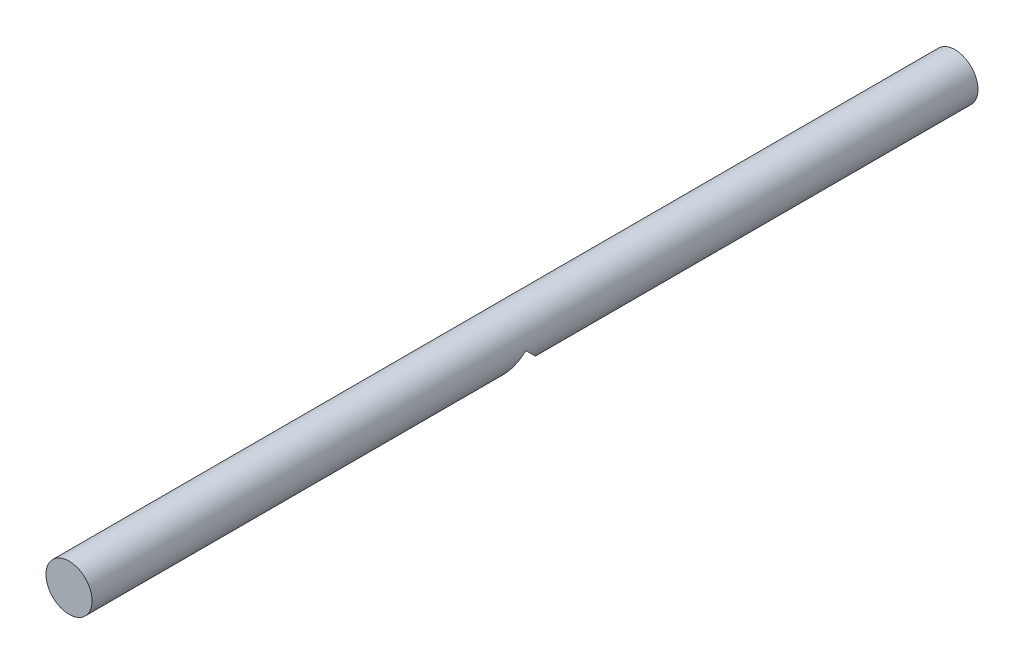
ISO-10303-21;
HEADER;
FILE_DESCRIPTION(('STEP AP214'),'2;1');
FILE_NAME('part.step','',(''),(''),'','','');
FILE_SCHEMA(('AUTOMOTIVE_DESIGN { 1 0 10303 214 1 1 1 1 }'));
ENDSEC;
DATA;
#1=APPLICATION_CONTEXT('core data for automotive mechanical design processes');
#2=APPLICATION_PROTOCOL_DEFINITION('international standard','automotive_design',2000,#1);
#3=PRODUCT_CONTEXT('',#1,'mechanical');
#4=PRODUCT('Part','Part','',(#3));
#5=PRODUCT_RELATED_PRODUCT_CATEGORY('part','',(#4));
#6=PRODUCT_DEFINITION_FORMATION('','',#4);
#7=PRODUCT_DEFINITION_CONTEXT('part definition',#1,'design');
#8=PRODUCT_DEFINITION('design','',#6,#7);
#9=PRODUCT_DEFINITION_SHAPE('','',#8);
#10=(LENGTH_UNIT() NAMED_UNIT(*) SI_UNIT(.MILLI.,.METRE.));
#11=(NAMED_UNIT(*) PLANE_ANGLE_UNIT() SI_UNIT($,.RADIAN.));
#12=(NAMED_UNIT(*) SI_UNIT($,.STERADIAN.) SOLID_ANGLE_UNIT());
#13=UNCERTAINTY_MEASURE_WITH_UNIT(LENGTH_MEASURE(1.E-05),#10,'distance_accuracy_value','');
#14=(GEOMETRIC_REPRESENTATION_CONTEXT(3) GLOBAL_UNCERTAINTY_ASSIGNED_CONTEXT((#13)) GLOBAL_UNIT_ASSIGNED_CONTEXT((#10,
#11,#12)) REPRESENTATION_CONTEXT('',''));
#15=CARTESIAN_POINT('',(0.,0.,0.));
#16=DIRECTION('',(0.,0.,1.));
#17=DIRECTION('',(1.,0.,0.));
#18=AXIS2_PLACEMENT_3D('',#15,#16,#17);
#19=CARTESIAN_POINT('',(0.,0.,480.));
#20=DIRECTION('',(0.,0.,-1.));
#21=DIRECTION('',(-1.,0.,0.));
#22=AXIS2_PLACEMENT_3D('',#19,#20,#21);
#23=CYLINDRICAL_SURFACE('',#22,12.5);
#24=CARTESIAN_POINT('',(0.,0.,245.));
#25=DIRECTION('',(0.,-0.707106781186547,-0.707106781186547));
#26=DIRECTION('',(0.,0.707106781186547,-0.707106781186547));
#27=AXIS2_PLACEMENT_3D('',#24,#25,#26);
#28=ELLIPSE('',#27,17.6776695296637,12.5);
#29=CARTESIAN_POINT('',(-12.5,0.,245.));
#30=VERTEX_POINT('',#29);
#31=CARTESIAN_POINT('',(12.5,0.,245.));
#32=VERTEX_POINT('',#31);
#33=EDGE_CURVE('E40',#30,#32,#28,.F.);
#34=ORIENTED_EDGE('',*,*,#33,.T.);
#35=CARTESIAN_POINT('',(0.,0.,245.));
#36=DIRECTION('',(0.,0.707106781186547,-0.707106781186547));
#37=DIRECTION('',(0.,-0.707106781186547,-0.707106781186547));
#38=AXIS2_PLACEMENT_3D('',#35,#36,#37);
#39=ELLIPSE('',#38,17.6776695296637,12.5);
#40=EDGE_CURVE('E11',#32,#30,#39,.T.);
#41=ORIENTED_EDGE('',*,*,#40,.T.);
#42=EDGE_LOOP('',(#34,#41));
#43=FACE_BOUND('',#42,.T.);
#44=CARTESIAN_POINT('',(0.,0.,480.));
#45=DIRECTION('',(0.,0.,1.));
#46=DIRECTION('',(1.,0.,0.));
#47=AXIS2_PLACEMENT_3D('',#44,#45,#46);
#48=CIRCLE('',#47,12.5);
#49=CARTESIAN_POINT('',(12.5,0.,480.));
#50=VERTEX_POINT('',#49);
#51=EDGE_CURVE('E55',#50,#50,#48,.T.);
#52=ORIENTED_EDGE('',*,*,#51,.F.);
#53=EDGE_LOOP('',(#52));
#54=FACE_BOUND('',#53,.T.);
#55=CARTESIAN_POINT('',(0.,0.,0.));
#56=DIRECTION('',(0.,0.,1.));
#57=DIRECTION('',(1.,0.,0.));
#58=AXIS2_PLACEMENT_3D('',#55,#56,#57);
#59=CIRCLE('',#58,12.5);
#60=CARTESIAN_POINT('',(12.5,0.,0.));
#61=VERTEX_POINT('',#60);
#62=EDGE_CURVE('E60',#61,#61,#59,.T.);
#63=ORIENTED_EDGE('',*,*,#62,.T.);
#64=EDGE_LOOP('',(#63));
#65=FACE_BOUND('',#64,.T.);
#66=ADVANCED_FACE('F33',(#43,#54,#65),#23,.T.);
#67=CARTESIAN_POINT('',(0.,0.,480.));
#68=DIRECTION('',(0.,0.,1.));
#69=DIRECTION('',(1.,0.,0.));
#70=AXIS2_PLACEMENT_3D('',#67,#68,#69);
#71=PLANE('',#70);
#72=ORIENTED_EDGE('',*,*,#51,.T.);
#73=EDGE_LOOP('',(#72));
#74=FACE_BOUND('',#73,.T.);
#75=ADVANCED_FACE('F63',(#74),#71,.T.);
#76=CARTESIAN_POINT('',(0.,0.,0.));
#77=DIRECTION('',(0.,0.,1.));
#78=DIRECTION('',(1.,0.,0.));
#79=AXIS2_PLACEMENT_3D('',#76,#77,#78);
#80=PLANE('',#79);
#81=ORIENTED_EDGE('',*,*,#62,.F.);
#82=EDGE_LOOP('',(#81));
#83=FACE_BOUND('',#82,.T.);
#84=ADVANCED_FACE('F74',(#83),#80,.F.);
#85=CARTESIAN_POINT('',(0.,-20.,245.));
#86=DIRECTION('',(0.,1.,0.));
#87=DIRECTION('',(0.,0.,1.));
#88=AXIS2_PLACEMENT_3D('',#85,#86,#87);
#89=CYLINDRICAL_SURFACE('',#88,12.5);
#90=CARTESIAN_POINT('',(0.,0.,245.));
#91=DIRECTION('',(0.,1.,0.));
#92=DIRECTION('',(0.,0.,1.));
#93=AXIS2_PLACEMENT_3D('',#90,#91,#92);
#94=CIRCLE('',#93,12.5);
#95=EDGE_CURVE('E46',#32,#30,#94,.T.);
#96=ORIENTED_EDGE('',*,*,#95,.T.);
#97=ORIENTED_EDGE('',*,*,#40,.F.);
#98=EDGE_LOOP('',(#96,#97));
#99=FACE_BOUND('',#98,.T.);
#100=ADVANCED_FACE('F59',(#99),#89,.F.);
#101=EDGE_CURVE('E52',#30,#32,#94,.T.);
#102=ORIENTED_EDGE('',*,*,#101,.T.);
#103=ORIENTED_EDGE('',*,*,#33,.F.);
#104=EDGE_LOOP('',(#102,#103));
#105=FACE_BOUND('',#104,.T.);
#106=ADVANCED_FACE('F51',(#105),#89,.F.);
#107=CARTESIAN_POINT('',(0.,0.,245.));
#108=DIRECTION('',(0.,1.,0.));
#109=DIRECTION('',(0.,0.,1.));
#110=AXIS2_PLACEMENT_3D('',#107,#108,#109);
#111=PLANE('',#110);
#112=ORIENTED_EDGE('',*,*,#95,.F.);
#113=ORIENTED_EDGE('',*,*,#101,.F.);
#114=EDGE_LOOP('',(#112,#113));
#115=FACE_BOUND('',#114,.T.);
#116=ADVANCED_FACE('F56',(#115),#111,.F.);
#117=CLOSED_SHELL('',(#66,#75,#84,#100,#106,#116));
#118=MANIFOLD_SOLID_BREP('B2',#117);
#119=ADVANCED_BREP_SHAPE_REPRESENTATION('',(#18,#118),#14);
#120=SHAPE_DEFINITION_REPRESENTATION(#9,#119);
ENDSEC;
END-ISO-10303-21;
